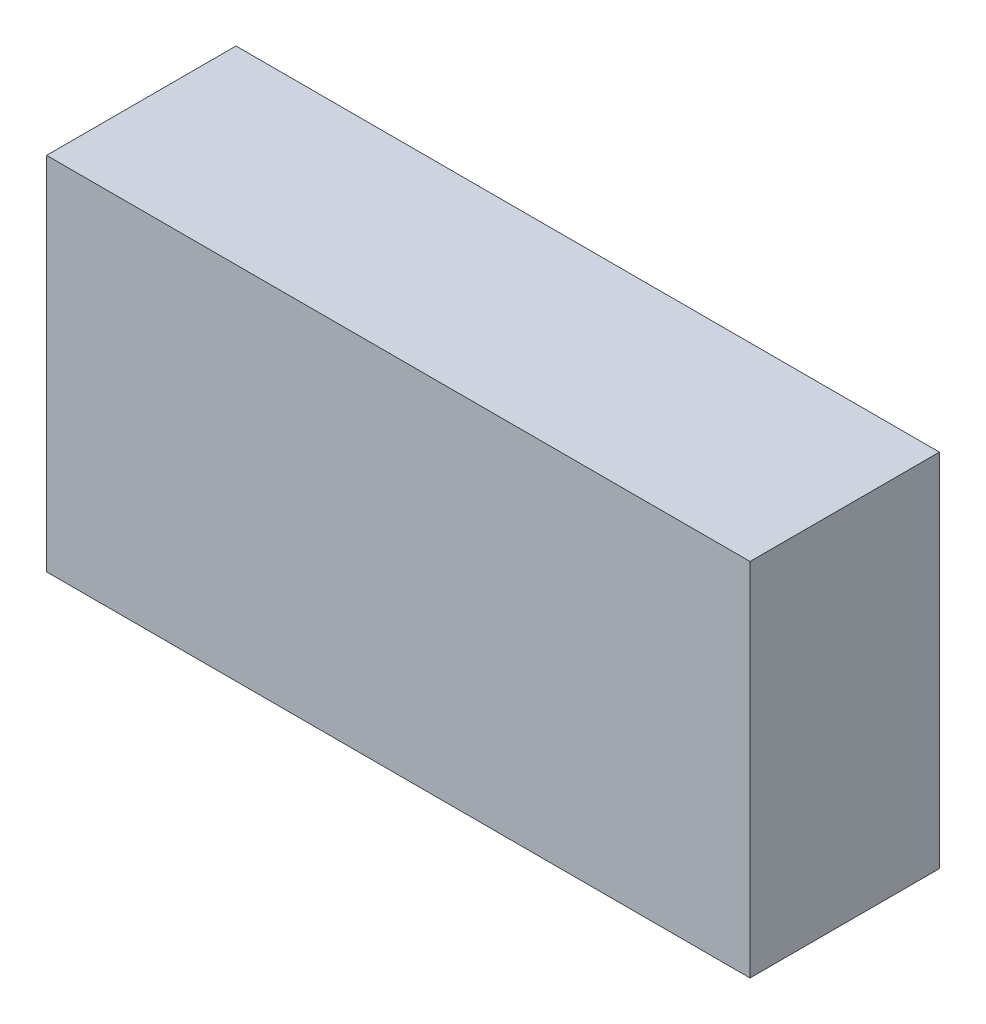
ISO-10303-21;
HEADER;
FILE_DESCRIPTION(('STEP AP214'),'2;1');
FILE_NAME('part.step','',(''),(''),'','','');
FILE_SCHEMA(('AUTOMOTIVE_DESIGN { 1 0 10303 214 1 1 1 1 }'));
ENDSEC;
DATA;
#1=APPLICATION_CONTEXT('core data for automotive mechanical design processes');
#2=APPLICATION_PROTOCOL_DEFINITION('international standard','automotive_design',2000,#1);
#3=PRODUCT_CONTEXT('',#1,'mechanical');
#4=PRODUCT('Part','Part','',(#3));
#5=PRODUCT_RELATED_PRODUCT_CATEGORY('part','',(#4));
#6=PRODUCT_DEFINITION_FORMATION('','',#4);
#7=PRODUCT_DEFINITION_CONTEXT('part definition',#1,'design');
#8=PRODUCT_DEFINITION('design','',#6,#7);
#9=PRODUCT_DEFINITION_SHAPE('','',#8);
#10=(LENGTH_UNIT() NAMED_UNIT(*) SI_UNIT(.MILLI.,.METRE.));
#11=(NAMED_UNIT(*) PLANE_ANGLE_UNIT() SI_UNIT($,.RADIAN.));
#12=(NAMED_UNIT(*) SI_UNIT($,.STERADIAN.) SOLID_ANGLE_UNIT());
#13=UNCERTAINTY_MEASURE_WITH_UNIT(LENGTH_MEASURE(1.E-05),#10,'distance_accuracy_value','');
#14=(GEOMETRIC_REPRESENTATION_CONTEXT(3) GLOBAL_UNCERTAINTY_ASSIGNED_CONTEXT((#13)) GLOBAL_UNIT_ASSIGNED_CONTEXT((#10,
#11,#12)) REPRESENTATION_CONTEXT('',''));
#15=CARTESIAN_POINT('',(0.,0.,0.));
#16=DIRECTION('',(0.,0.,1.));
#17=DIRECTION('',(1.,0.,0.));
#18=AXIS2_PLACEMENT_3D('',#15,#16,#17);
#19=CARTESIAN_POINT('',(39.,20.,21.));
#20=DIRECTION('',(-1.,0.,0.));
#21=DIRECTION('',(0.,-1.,0.));
#22=AXIS2_PLACEMENT_3D('',#19,#20,#21);
#23=PLANE('',#22);
#24=DIRECTION('',(0.,1.,0.));
#25=VECTOR('',#24,1.);
#26=CARTESIAN_POINT('',(39.,20.,0.));
#27=LINE('',#26,#25);
#28=CARTESIAN_POINT('',(39.,-20.,0.));
#29=VERTEX_POINT('',#28);
#30=CARTESIAN_POINT('',(39.,20.,0.));
#31=VERTEX_POINT('',#30);
#32=EDGE_CURVE('E98',#29,#31,#27,.T.);
#33=ORIENTED_EDGE('',*,*,#32,.T.);
#34=DIRECTION('',(0.,0.,-1.));
#35=VECTOR('',#34,1.);
#36=CARTESIAN_POINT('',(39.,20.,21.));
#37=LINE('',#36,#35);
#38=CARTESIAN_POINT('',(39.,20.,21.));
#39=VERTEX_POINT('',#38);
#40=EDGE_CURVE('E11',#39,#31,#37,.T.);
#41=ORIENTED_EDGE('',*,*,#40,.F.);
#42=DIRECTION('',(0.,1.,0.));
#43=VECTOR('',#42,1.);
#44=CARTESIAN_POINT('',(39.,20.,21.));
#45=LINE('',#44,#43);
#46=CARTESIAN_POINT('',(39.,-20.,21.));
#47=VERTEX_POINT('',#46);
#48=EDGE_CURVE('E86',#47,#39,#45,.T.);
#49=ORIENTED_EDGE('',*,*,#48,.F.);
#50=DIRECTION('',(0.,0.,-1.));
#51=VECTOR('',#50,1.);
#52=CARTESIAN_POINT('',(39.,-20.,21.));
#53=LINE('',#52,#51);
#54=EDGE_CURVE('E94',#47,#29,#53,.T.);
#55=ORIENTED_EDGE('',*,*,#54,.T.);
#56=EDGE_LOOP('',(#33,#41,#49,#55));
#57=FACE_BOUND('',#56,.T.);
#58=ADVANCED_FACE('F35',(#57),#23,.F.);
#59=CARTESIAN_POINT('',(-39.,20.,21.));
#60=DIRECTION('',(0.,-1.,0.));
#61=DIRECTION('',(1.,0.,0.));
#62=AXIS2_PLACEMENT_3D('',#59,#60,#61);
#63=PLANE('',#62);
#64=DIRECTION('',(-1.,0.,0.));
#65=VECTOR('',#64,1.);
#66=CARTESIAN_POINT('',(-39.,20.,0.));
#67=LINE('',#66,#65);
#68=CARTESIAN_POINT('',(-39.,20.,0.));
#69=VERTEX_POINT('',#68);
#70=EDGE_CURVE('E90',#31,#69,#67,.T.);
#71=ORIENTED_EDGE('',*,*,#70,.T.);
#72=DIRECTION('',(0.,0.,-1.));
#73=VECTOR('',#72,1.);
#74=CARTESIAN_POINT('',(-39.,20.,21.));
#75=LINE('',#74,#73);
#76=CARTESIAN_POINT('',(-39.,20.,21.));
#77=VERTEX_POINT('',#76);
#78=EDGE_CURVE('E43',#77,#69,#75,.T.);
#79=ORIENTED_EDGE('',*,*,#78,.F.);
#80=DIRECTION('',(-1.,0.,0.));
#81=VECTOR('',#80,1.);
#82=CARTESIAN_POINT('',(-39.,20.,21.));
#83=LINE('',#82,#81);
#84=EDGE_CURVE('E81',#39,#77,#83,.T.);
#85=ORIENTED_EDGE('',*,*,#84,.F.);
#86=ORIENTED_EDGE('',*,*,#40,.T.);
#87=EDGE_LOOP('',(#71,#79,#85,#86));
#88=FACE_BOUND('',#87,.T.);
#89=ADVANCED_FACE('F89',(#88),#63,.F.);
#90=CARTESIAN_POINT('',(-39.,20.,21.));
#91=DIRECTION('',(1.,0.,0.));
#92=DIRECTION('',(0.,0.,-1.));
#93=AXIS2_PLACEMENT_3D('',#90,#91,#92);
#94=PLANE('',#93);
#95=DIRECTION('',(0.,-1.,0.));
#96=VECTOR('',#95,1.);
#97=CARTESIAN_POINT('',(-39.,20.,0.));
#98=LINE('',#97,#96);
#99=CARTESIAN_POINT('',(-39.,-20.,0.));
#100=VERTEX_POINT('',#99);
#101=EDGE_CURVE('E68',#69,#100,#98,.T.);
#102=ORIENTED_EDGE('',*,*,#101,.T.);
#103=DIRECTION('',(0.,0.,-1.));
#104=VECTOR('',#103,1.);
#105=CARTESIAN_POINT('',(-39.,-20.,21.));
#106=LINE('',#105,#104);
#107=CARTESIAN_POINT('',(-39.,-20.,21.));
#108=VERTEX_POINT('',#107);
#109=EDGE_CURVE('E91',#108,#100,#106,.T.);
#110=ORIENTED_EDGE('',*,*,#109,.F.);
#111=DIRECTION('',(0.,-1.,0.));
#112=VECTOR('',#111,1.);
#113=CARTESIAN_POINT('',(-39.,20.,21.));
#114=LINE('',#113,#112);
#115=EDGE_CURVE('E84',#77,#108,#114,.T.);
#116=ORIENTED_EDGE('',*,*,#115,.F.);
#117=ORIENTED_EDGE('',*,*,#78,.T.);
#118=EDGE_LOOP('',(#102,#110,#116,#117));
#119=FACE_BOUND('',#118,.T.);
#120=ADVANCED_FACE('F92',(#119),#94,.F.);
#121=CARTESIAN_POINT('',(-39.,-20.,21.));
#122=DIRECTION('',(0.,1.,0.));
#123=DIRECTION('',(0.,0.,1.));
#124=AXIS2_PLACEMENT_3D('',#121,#122,#123);
#125=PLANE('',#124);
#126=DIRECTION('',(1.,0.,0.));
#127=VECTOR('',#126,1.);
#128=CARTESIAN_POINT('',(-39.,-20.,0.));
#129=LINE('',#128,#127);
#130=EDGE_CURVE('E74',#100,#29,#129,.T.);
#131=ORIENTED_EDGE('',*,*,#130,.T.);
#132=ORIENTED_EDGE('',*,*,#54,.F.);
#133=DIRECTION('',(1.,0.,0.));
#134=VECTOR('',#133,1.);
#135=CARTESIAN_POINT('',(-39.,-20.,21.));
#136=LINE('',#135,#134);
#137=EDGE_CURVE('E51',#108,#47,#136,.T.);
#138=ORIENTED_EDGE('',*,*,#137,.F.);
#139=ORIENTED_EDGE('',*,*,#109,.T.);
#140=EDGE_LOOP('',(#131,#132,#138,#139));
#141=FACE_BOUND('',#140,.T.);
#142=ADVANCED_FACE('F105',(#141),#125,.F.);
#143=CARTESIAN_POINT('',(0.,0.,21.));
#144=DIRECTION('',(0.,0.,1.));
#145=DIRECTION('',(1.,0.,0.));
#146=AXIS2_PLACEMENT_3D('',#143,#144,#145);
#147=PLANE('',#146);
#148=ORIENTED_EDGE('',*,*,#48,.T.);
#149=ORIENTED_EDGE('',*,*,#84,.T.);
#150=ORIENTED_EDGE('',*,*,#115,.T.);
#151=ORIENTED_EDGE('',*,*,#137,.T.);
#152=EDGE_LOOP('',(#148,#149,#150,#151));
#153=FACE_BOUND('',#152,.T.);
#154=ADVANCED_FACE('F82',(#153),#147,.T.);
#155=CARTESIAN_POINT('',(0.,0.,0.));
#156=DIRECTION('',(0.,0.,1.));
#157=DIRECTION('',(1.,0.,0.));
#158=AXIS2_PLACEMENT_3D('',#155,#156,#157);
#159=PLANE('',#158);
#160=ORIENTED_EDGE('',*,*,#32,.F.);
#161=ORIENTED_EDGE('',*,*,#130,.F.);
#162=ORIENTED_EDGE('',*,*,#101,.F.);
#163=ORIENTED_EDGE('',*,*,#70,.F.);
#164=EDGE_LOOP('',(#160,#161,#162,#163));
#165=FACE_BOUND('',#164,.T.);
#166=ADVANCED_FACE('F108',(#165),#159,.F.);
#167=CLOSED_SHELL('',(#58,#89,#120,#142,#154,#166));
#168=MANIFOLD_SOLID_BREP('B2',#167);
#169=ADVANCED_BREP_SHAPE_REPRESENTATION('',(#18,#168),#14);
#170=SHAPE_DEFINITION_REPRESENTATION(#9,#169);
ENDSEC;
END-ISO-10303-21;
